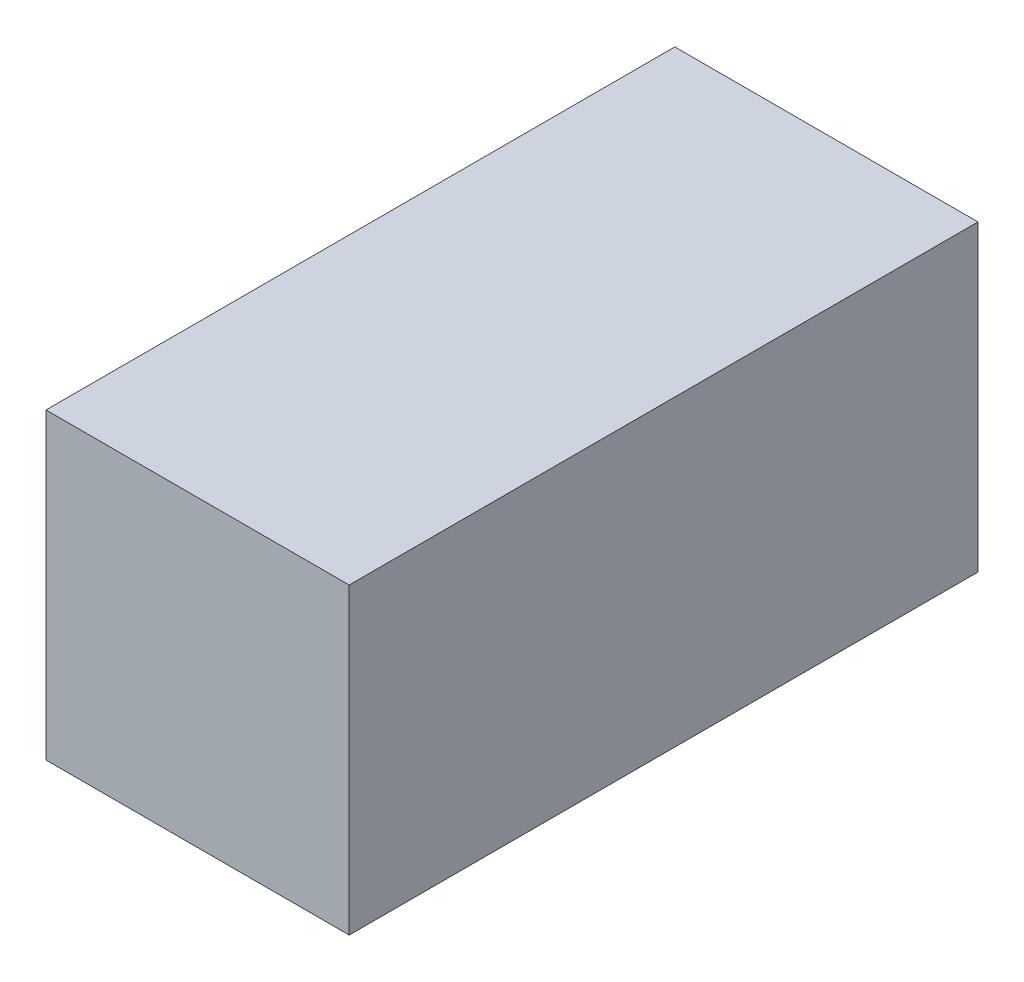
ISO-10303-21;
HEADER;
FILE_DESCRIPTION(('STEP AP214'),'2;1');
FILE_NAME('part.step','',(''),(''),'','','');
FILE_SCHEMA(('AUTOMOTIVE_DESIGN { 1 0 10303 214 1 1 1 1 }'));
ENDSEC;
DATA;
#1=APPLICATION_CONTEXT('core data for automotive mechanical design processes');
#2=APPLICATION_PROTOCOL_DEFINITION('international standard','automotive_design',2000,#1);
#3=PRODUCT_CONTEXT('',#1,'mechanical');
#4=PRODUCT('Part','Part','',(#3));
#5=PRODUCT_RELATED_PRODUCT_CATEGORY('part','',(#4));
#6=PRODUCT_DEFINITION_FORMATION('','',#4);
#7=PRODUCT_DEFINITION_CONTEXT('part definition',#1,'design');
#8=PRODUCT_DEFINITION('design','',#6,#7);
#9=PRODUCT_DEFINITION_SHAPE('','',#8);
#10=(LENGTH_UNIT() NAMED_UNIT(*) SI_UNIT(.MILLI.,.METRE.));
#11=(NAMED_UNIT(*) PLANE_ANGLE_UNIT() SI_UNIT($,.RADIAN.));
#12=(NAMED_UNIT(*) SI_UNIT($,.STERADIAN.) SOLID_ANGLE_UNIT());
#13=UNCERTAINTY_MEASURE_WITH_UNIT(LENGTH_MEASURE(1.E-05),#10,'distance_accuracy_value','');
#14=(GEOMETRIC_REPRESENTATION_CONTEXT(3) GLOBAL_UNCERTAINTY_ASSIGNED_CONTEXT((#13)) GLOBAL_UNIT_ASSIGNED_CONTEXT((#10,
#11,#12)) REPRESENTATION_CONTEXT('',''));
#15=CARTESIAN_POINT('',(0.,0.,0.));
#16=DIRECTION('',(0.,0.,1.));
#17=DIRECTION('',(1.,0.,0.));
#18=AXIS2_PLACEMENT_3D('',#15,#16,#17);
#19=CARTESIAN_POINT('',(50.,100.,-103.7035));
#20=DIRECTION('',(-1.,0.,0.));
#21=DIRECTION('',(0.,0.,1.));
#22=AXIS2_PLACEMENT_3D('',#19,#20,#21);
#23=PLANE('',#22);
#24=DIRECTION('',(0.,0.,-1.));
#25=VECTOR('',#24,1.);
#26=CARTESIAN_POINT('',(50.,0.,-103.7035));
#27=LINE('',#26,#25);
#28=CARTESIAN_POINT('',(50.,0.,103.7035));
#29=VERTEX_POINT('',#28);
#30=CARTESIAN_POINT('',(50.,0.,-103.7035));
#31=VERTEX_POINT('',#30);
#32=EDGE_CURVE('E96',#29,#31,#27,.T.);
#33=ORIENTED_EDGE('',*,*,#32,.T.);
#34=DIRECTION('',(0.,-1.,0.));
#35=VECTOR('',#34,1.);
#36=CARTESIAN_POINT('',(50.,100.,-103.7035));
#37=LINE('',#36,#35);
#38=CARTESIAN_POINT('',(50.,100.,-103.7035));
#39=VERTEX_POINT('',#38);
#40=EDGE_CURVE('E11',#39,#31,#37,.T.);
#41=ORIENTED_EDGE('',*,*,#40,.F.);
#42=DIRECTION('',(0.,0.,-1.));
#43=VECTOR('',#42,1.);
#44=CARTESIAN_POINT('',(50.,100.,-103.7035));
#45=LINE('',#44,#43);
#46=CARTESIAN_POINT('',(50.,100.,103.7035));
#47=VERTEX_POINT('',#46);
#48=EDGE_CURVE('E84',#47,#39,#45,.T.);
#49=ORIENTED_EDGE('',*,*,#48,.F.);
#50=DIRECTION('',(0.,-1.,0.));
#51=VECTOR('',#50,1.);
#52=CARTESIAN_POINT('',(50.,100.,103.7035));
#53=LINE('',#52,#51);
#54=EDGE_CURVE('E92',#47,#29,#53,.T.);
#55=ORIENTED_EDGE('',*,*,#54,.T.);
#56=EDGE_LOOP('',(#33,#41,#49,#55));
#57=FACE_BOUND('',#56,.T.);
#58=ADVANCED_FACE('F33',(#57),#23,.F.);
#59=CARTESIAN_POINT('',(-50.,100.,-103.7035));
#60=DIRECTION('',(0.,0.,1.));
#61=DIRECTION('',(1.,0.,0.));
#62=AXIS2_PLACEMENT_3D('',#59,#60,#61);
#63=PLANE('',#62);
#64=DIRECTION('',(-1.,0.,0.));
#65=VECTOR('',#64,1.);
#66=CARTESIAN_POINT('',(-50.,0.,-103.7035));
#67=LINE('',#66,#65);
#68=CARTESIAN_POINT('',(-50.,0.,-103.7035));
#69=VERTEX_POINT('',#68);
#70=EDGE_CURVE('E88',#31,#69,#67,.T.);
#71=ORIENTED_EDGE('',*,*,#70,.T.);
#72=DIRECTION('',(0.,-1.,0.));
#73=VECTOR('',#72,1.);
#74=CARTESIAN_POINT('',(-50.,100.,-103.7035));
#75=LINE('',#74,#73);
#76=CARTESIAN_POINT('',(-50.,100.,-103.7035));
#77=VERTEX_POINT('',#76);
#78=EDGE_CURVE('E41',#77,#69,#75,.T.);
#79=ORIENTED_EDGE('',*,*,#78,.F.);
#80=DIRECTION('',(-1.,0.,0.));
#81=VECTOR('',#80,1.);
#82=CARTESIAN_POINT('',(-50.,100.,-103.7035));
#83=LINE('',#82,#81);
#84=EDGE_CURVE('E79',#39,#77,#83,.T.);
#85=ORIENTED_EDGE('',*,*,#84,.F.);
#86=ORIENTED_EDGE('',*,*,#40,.T.);
#87=EDGE_LOOP('',(#71,#79,#85,#86));
#88=FACE_BOUND('',#87,.T.);
#89=ADVANCED_FACE('F87',(#88),#63,.F.);
#90=CARTESIAN_POINT('',(-50.,100.,-103.7035));
#91=DIRECTION('',(1.,0.,0.));
#92=DIRECTION('',(0.,0.,-1.));
#93=AXIS2_PLACEMENT_3D('',#90,#91,#92);
#94=PLANE('',#93);
#95=DIRECTION('',(0.,0.,1.));
#96=VECTOR('',#95,1.);
#97=CARTESIAN_POINT('',(-50.,0.,-103.7035));
#98=LINE('',#97,#96);
#99=CARTESIAN_POINT('',(-50.,0.,103.7035));
#100=VERTEX_POINT('',#99);
#101=EDGE_CURVE('E66',#69,#100,#98,.T.);
#102=ORIENTED_EDGE('',*,*,#101,.T.);
#103=DIRECTION('',(0.,-1.,0.));
#104=VECTOR('',#103,1.);
#105=CARTESIAN_POINT('',(-50.,100.,103.7035));
#106=LINE('',#105,#104);
#107=CARTESIAN_POINT('',(-50.,100.,103.7035));
#108=VERTEX_POINT('',#107);
#109=EDGE_CURVE('E89',#108,#100,#106,.T.);
#110=ORIENTED_EDGE('',*,*,#109,.F.);
#111=DIRECTION('',(0.,0.,1.));
#112=VECTOR('',#111,1.);
#113=CARTESIAN_POINT('',(-50.,100.,-103.7035));
#114=LINE('',#113,#112);
#115=EDGE_CURVE('E82',#77,#108,#114,.T.);
#116=ORIENTED_EDGE('',*,*,#115,.F.);
#117=ORIENTED_EDGE('',*,*,#78,.T.);
#118=EDGE_LOOP('',(#102,#110,#116,#117));
#119=FACE_BOUND('',#118,.T.);
#120=ADVANCED_FACE('F90',(#119),#94,.F.);
#121=CARTESIAN_POINT('',(-50.,100.,103.7035));
#122=DIRECTION('',(0.,0.,-1.));
#123=DIRECTION('',(-1.,0.,0.));
#124=AXIS2_PLACEMENT_3D('',#121,#122,#123);
#125=PLANE('',#124);
#126=DIRECTION('',(1.,0.,0.));
#127=VECTOR('',#126,1.);
#128=CARTESIAN_POINT('',(-50.,0.,103.7035));
#129=LINE('',#128,#127);
#130=EDGE_CURVE('E72',#100,#29,#129,.T.);
#131=ORIENTED_EDGE('',*,*,#130,.T.);
#132=ORIENTED_EDGE('',*,*,#54,.F.);
#133=DIRECTION('',(1.,0.,0.));
#134=VECTOR('',#133,1.);
#135=CARTESIAN_POINT('',(-50.,100.,103.7035));
#136=LINE('',#135,#134);
#137=EDGE_CURVE('E49',#108,#47,#136,.T.);
#138=ORIENTED_EDGE('',*,*,#137,.F.);
#139=ORIENTED_EDGE('',*,*,#109,.T.);
#140=EDGE_LOOP('',(#131,#132,#138,#139));
#141=FACE_BOUND('',#140,.T.);
#142=ADVANCED_FACE('F103',(#141),#125,.F.);
#143=CARTESIAN_POINT('',(0.,100.,0.));
#144=DIRECTION('',(0.,1.,0.));
#145=DIRECTION('',(0.,0.,1.));
#146=AXIS2_PLACEMENT_3D('',#143,#144,#145);
#147=PLANE('',#146);
#148=ORIENTED_EDGE('',*,*,#48,.T.);
#149=ORIENTED_EDGE('',*,*,#84,.T.);
#150=ORIENTED_EDGE('',*,*,#115,.T.);
#151=ORIENTED_EDGE('',*,*,#137,.T.);
#152=EDGE_LOOP('',(#148,#149,#150,#151));
#153=FACE_BOUND('',#152,.T.);
#154=ADVANCED_FACE('F80',(#153),#147,.T.);
#155=CARTESIAN_POINT('',(0.,0.,0.));
#156=DIRECTION('',(0.,1.,0.));
#157=DIRECTION('',(0.,0.,1.));
#158=AXIS2_PLACEMENT_3D('',#155,#156,#157);
#159=PLANE('',#158);
#160=ORIENTED_EDGE('',*,*,#32,.F.);
#161=ORIENTED_EDGE('',*,*,#130,.F.);
#162=ORIENTED_EDGE('',*,*,#101,.F.);
#163=ORIENTED_EDGE('',*,*,#70,.F.);
#164=EDGE_LOOP('',(#160,#161,#162,#163));
#165=FACE_BOUND('',#164,.T.);
#166=ADVANCED_FACE('F106',(#165),#159,.F.);
#167=CLOSED_SHELL('',(#58,#89,#120,#142,#154,#166));
#168=MANIFOLD_SOLID_BREP('B2',#167);
#169=ADVANCED_BREP_SHAPE_REPRESENTATION('',(#18,#168),#14);
#170=SHAPE_DEFINITION_REPRESENTATION(#9,#169);
ENDSEC;
END-ISO-10303-21;
